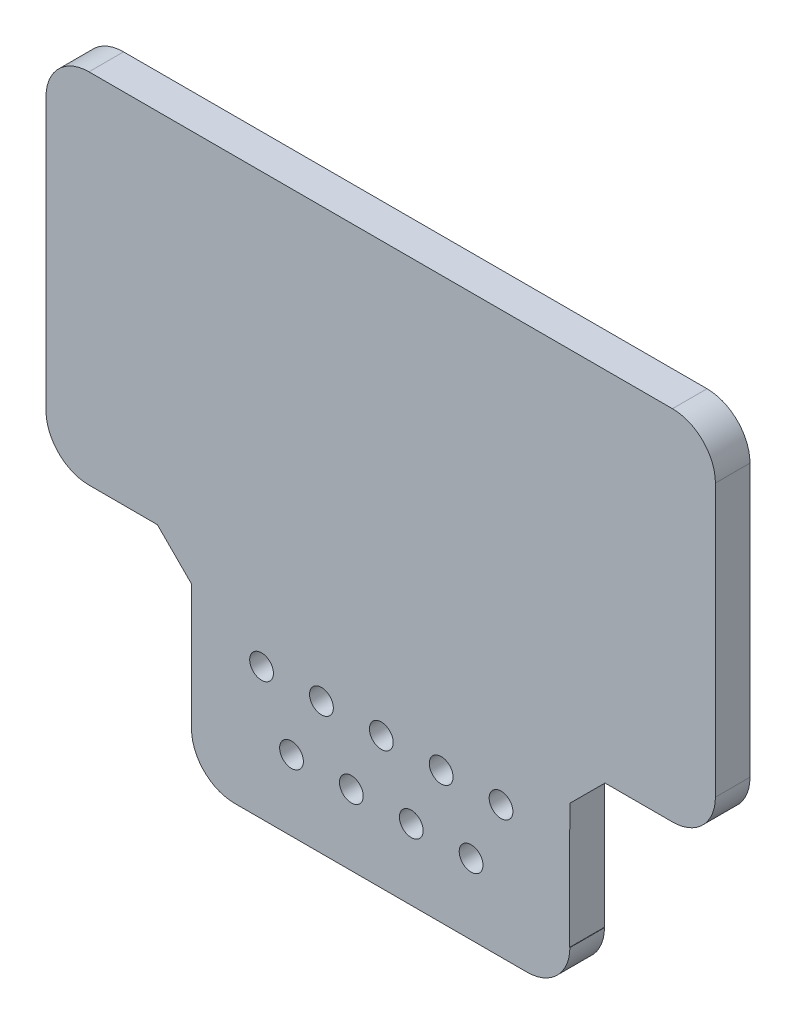
ISO-10303-21;
HEADER;
FILE_DESCRIPTION(('STEP AP214'),'2;1');
FILE_NAME('part.step','',(''),(''),'','','');
FILE_SCHEMA(('AUTOMOTIVE_DESIGN { 1 0 10303 214 1 1 1 1 }'));
ENDSEC;
DATA;
#1=APPLICATION_CONTEXT('core data for automotive mechanical design processes');
#2=APPLICATION_PROTOCOL_DEFINITION('international standard','automotive_design',2000,#1);
#3=PRODUCT_CONTEXT('',#1,'mechanical');
#4=PRODUCT('Part','Part','',(#3));
#5=PRODUCT_RELATED_PRODUCT_CATEGORY('part','',(#4));
#6=PRODUCT_DEFINITION_FORMATION('','',#4);
#7=PRODUCT_DEFINITION_CONTEXT('part definition',#1,'design');
#8=PRODUCT_DEFINITION('design','',#6,#7);
#9=PRODUCT_DEFINITION_SHAPE('','',#8);
#10=(LENGTH_UNIT() NAMED_UNIT(*) SI_UNIT(.MILLI.,.METRE.));
#11=(NAMED_UNIT(*) PLANE_ANGLE_UNIT() SI_UNIT($,.RADIAN.));
#12=(NAMED_UNIT(*) SI_UNIT($,.STERADIAN.) SOLID_ANGLE_UNIT());
#13=UNCERTAINTY_MEASURE_WITH_UNIT(LENGTH_MEASURE(1.E-05),#10,'distance_accuracy_value','');
#14=(GEOMETRIC_REPRESENTATION_CONTEXT(3) GLOBAL_UNCERTAINTY_ASSIGNED_CONTEXT((#13)) GLOBAL_UNIT_ASSIGNED_CONTEXT((#10,
#11,#12)) REPRESENTATION_CONTEXT('',''));
#15=CARTESIAN_POINT('',(0.,0.,0.));
#16=DIRECTION('',(0.,0.,1.));
#17=DIRECTION('',(1.,0.,0.));
#18=AXIS2_PLACEMENT_3D('',#15,#16,#17);
#19=CARTESIAN_POINT('',(103.63220726441,-45.05379222758,0.));
#20=DIRECTION('',(0.,0.,-1.));
#21=DIRECTION('',(-1.,0.,0.));
#22=AXIS2_PLACEMENT_3D('',#19,#20,#21);
#23=CYLINDRICAL_SURFACE('',#22,0.01270002540005);
#24=CARTESIAN_POINT('',(103.63220726441,-45.05379222758,1.600050800102));
#25=DIRECTION('',(0.,0.,-1.));
#26=DIRECTION('',(-1.,0.,0.));
#27=AXIS2_PLACEMENT_3D('',#24,#25,#26);
#28=CIRCLE('',#27,0.01270002540005);
#29=CARTESIAN_POINT('',(103.619507241386,-45.0537885438644,1.600050800102));
#30=VERTEX_POINT('',#29);
#31=CARTESIAN_POINT('',(103.629648645832,-45.06623184639,1.600050800102));
#32=VERTEX_POINT('',#31);
#33=EDGE_CURVE('E180',#30,#32,#28,.F.);
#34=ORIENTED_EDGE('',*,*,#33,.T.);
#35=DIRECTION('',(0.,0.,-1.));
#36=VECTOR('',#35,1.);
#37=CARTESIAN_POINT('',(103.629648645832,-45.06623184639,0.));
#38=LINE('',#37,#36);
#39=CARTESIAN_POINT('',(103.629648645832,-45.06623184639,0.));
#40=VERTEX_POINT('',#39);
#41=EDGE_CURVE('E301',#40,#32,#38,.F.);
#42=ORIENTED_EDGE('',*,*,#41,.F.);
#43=CARTESIAN_POINT('',(103.63220726441,-45.05379222758,0.));
#44=DIRECTION('',(0.,0.,-1.));
#45=DIRECTION('',(-1.,0.,0.));
#46=AXIS2_PLACEMENT_3D('',#43,#44,#45);
#47=CIRCLE('',#46,0.01270002540005);
#48=CARTESIAN_POINT('',(103.619507241385,-45.0537885438644,0.));
#49=VERTEX_POINT('',#48);
#50=EDGE_CURVE('E20',#49,#40,#47,.F.);
#51=ORIENTED_EDGE('',*,*,#50,.F.);
#52=DIRECTION('',(0.,0.,1.));
#53=VECTOR('',#52,1.);
#54=CARTESIAN_POINT('',(103.619507239012,-45.05379222758,0.));
#55=LINE('',#54,#53);
#56=EDGE_CURVE('E207',#30,#49,#55,.F.);
#57=ORIENTED_EDGE('',*,*,#56,.F.);
#58=EDGE_LOOP('',(#34,#42,#51,#57));
#59=FACE_BOUND('',#58,.T.);
#60=ADVANCED_FACE('F17',(#59),#23,.F.);
#61=CARTESIAN_POINT('',(94.8739811879,-32.76412805376,1.600050800102));
#62=DIRECTION('',(0.,0.,-1.));
#63=DIRECTION('',(-1.,0.,0.));
#64=AXIS2_PLACEMENT_3D('',#61,#62,#63);
#65=PLANE('',#64);
#66=CARTESIAN_POINT('',(89.362522225044,-40.93426466852,1.600050800102));
#67=DIRECTION('',(0.,0.,1.));
#68=DIRECTION('',(1.,0.,0.));
#69=AXIS2_PLACEMENT_3D('',#66,#67,#68);
#70=CIRCLE('',#69,0.550012700025);
#71=CARTESIAN_POINT('',(89.912534925069,-40.93426466852,1.600050800102));
#72=VERTEX_POINT('',#71);
#73=EDGE_CURVE('E264',#72,#72,#70,.F.);
#74=ORIENTED_EDGE('',*,*,#73,.T.);
#75=EDGE_LOOP('',(#74));
#76=FACE_BOUND('',#75,.T.);
#77=CARTESIAN_POINT('',(92.132651765304,-40.93426466852,1.600050800102));
#78=DIRECTION('',(0.,0.,1.));
#79=DIRECTION('',(1.,0.,0.));
#80=AXIS2_PLACEMENT_3D('',#77,#78,#79);
#81=CIRCLE('',#80,0.550012700025);
#82=CARTESIAN_POINT('',(92.682664465329,-40.93426466852,1.600050800102));
#83=VERTEX_POINT('',#82);
#84=EDGE_CURVE('E267',#83,#83,#81,.F.);
#85=ORIENTED_EDGE('',*,*,#84,.T.);
#86=EDGE_LOOP('',(#85));
#87=FACE_BOUND('',#86,.T.);
#88=CARTESIAN_POINT('',(94.902527305055,-40.93426466852,1.600050800102));
#89=DIRECTION('',(0.,0.,1.));
#90=DIRECTION('',(1.,0.,0.));
#91=AXIS2_PLACEMENT_3D('',#88,#89,#90);
#92=CIRCLE('',#91,0.550012700025);
#93=CARTESIAN_POINT('',(95.45254000508,-40.93426466852,1.600050800102));
#94=VERTEX_POINT('',#93);
#95=EDGE_CURVE('E270',#94,#94,#92,.F.);
#96=ORIENTED_EDGE('',*,*,#95,.T.);
#97=EDGE_LOOP('',(#96));
#98=FACE_BOUND('',#97,.T.);
#99=CARTESIAN_POINT('',(97.672656845314,-40.93426466852,1.600050800102));
#100=DIRECTION('',(0.,0.,1.));
#101=DIRECTION('',(1.,0.,0.));
#102=AXIS2_PLACEMENT_3D('',#99,#100,#101);
#103=CIRCLE('',#102,0.550012700025);
#104=CARTESIAN_POINT('',(98.222669545339,-40.93426466852,1.600050800102));
#105=VERTEX_POINT('',#104);
#106=EDGE_CURVE('E273',#105,#105,#103,.F.);
#107=ORIENTED_EDGE('',*,*,#106,.T.);
#108=EDGE_LOOP('',(#107));
#109=FACE_BOUND('',#108,.T.);
#110=CARTESIAN_POINT('',(100.44253238506,-40.93451866903,1.600050800102));
#111=DIRECTION('',(0.,0.,1.));
#112=DIRECTION('',(1.,0.,0.));
#113=AXIS2_PLACEMENT_3D('',#110,#111,#112);
#114=CIRCLE('',#113,0.550012700025);
#115=CARTESIAN_POINT('',(100.992545085085,-40.93451866903,1.600050800102));
#116=VERTEX_POINT('',#115);
#117=EDGE_CURVE('E276',#116,#116,#114,.F.);
#118=ORIENTED_EDGE('',*,*,#117,.T.);
#119=EDGE_LOOP('',(#118));
#120=FACE_BOUND('',#119,.T.);
#121=CARTESIAN_POINT('',(90.747586995174,-43.77424434848,1.600050800102));
#122=DIRECTION('',(0.,0.,1.));
#123=DIRECTION('',(1.,0.,0.));
#124=AXIS2_PLACEMENT_3D('',#121,#122,#123);
#125=CIRCLE('',#124,0.550012700025);
#126=CARTESIAN_POINT('',(91.297599695199,-43.77424434848,1.600050800102));
#127=VERTEX_POINT('',#126);
#128=EDGE_CURVE('E279',#127,#127,#125,.F.);
#129=ORIENTED_EDGE('',*,*,#128,.T.);
#130=EDGE_LOOP('',(#129));
#131=FACE_BOUND('',#130,.T.);
#132=CARTESIAN_POINT('',(93.517462534925,-43.77424434848,1.600050800102));
#133=DIRECTION('',(0.,0.,1.));
#134=DIRECTION('',(1.,0.,0.));
#135=AXIS2_PLACEMENT_3D('',#132,#133,#134);
#136=CIRCLE('',#135,0.550012700025);
#137=CARTESIAN_POINT('',(94.06747523495,-43.77424434848,1.600050800102));
#138=VERTEX_POINT('',#137);
#139=EDGE_CURVE('E282',#138,#138,#136,.F.);
#140=ORIENTED_EDGE('',*,*,#139,.T.);
#141=EDGE_LOOP('',(#140));
#142=FACE_BOUND('',#141,.T.);
#143=CARTESIAN_POINT('',(96.287592075184,-43.77424434848,1.600050800102));
#144=DIRECTION('',(0.,0.,1.));
#145=DIRECTION('',(1.,0.,0.));
#146=AXIS2_PLACEMENT_3D('',#143,#144,#145);
#147=CIRCLE('',#146,0.550012700025);
#148=CARTESIAN_POINT('',(96.837604775209,-43.77424434848,1.600050800102));
#149=VERTEX_POINT('',#148);
#150=EDGE_CURVE('E285',#149,#149,#147,.F.);
#151=ORIENTED_EDGE('',*,*,#150,.T.);
#152=EDGE_LOOP('',(#151));
#153=FACE_BOUND('',#152,.T.);
#154=CARTESIAN_POINT('',(99.057467614935,-43.77424434848,1.600050800102));
#155=DIRECTION('',(0.,0.,1.));
#156=DIRECTION('',(1.,0.,0.));
#157=AXIS2_PLACEMENT_3D('',#154,#155,#156);
#158=CIRCLE('',#157,0.550012700025);
#159=CARTESIAN_POINT('',(99.60748031496,-43.77424434848,1.600050800102));
#160=VERTEX_POINT('',#159);
#161=EDGE_CURVE('E288',#160,#160,#158,.F.);
#162=ORIENTED_EDGE('',*,*,#161,.T.);
#163=EDGE_LOOP('',(#162));
#164=FACE_BOUND('',#163,.T.);
#165=DIRECTION('',(0.,1.,0.));
#166=VECTOR('',#165,1.);
#167=CARTESIAN_POINT('',(79.387858775718,-35.66959359918,1.600050800102));
#168=LINE('',#167,#166);
#169=CARTESIAN_POINT('',(79.387858775718,-35.66959359918,1.600050800102));
#170=VERTEX_POINT('',#169);
#171=CARTESIAN_POINT('',(79.387858775718,-23.08204724409,1.600050800102));
#172=VERTEX_POINT('',#171);
#173=EDGE_CURVE('E181',#170,#172,#168,.T.);
#174=ORIENTED_EDGE('',*,*,#173,.F.);
#175=CARTESIAN_POINT('',(81.375163830328,-35.66959359918,1.600050800102));
#176=DIRECTION('',(0.,0.,-1.));
#177=DIRECTION('',(-1.,0.,0.));
#178=AXIS2_PLACEMENT_3D('',#175,#176,#177);
#179=CIRCLE('',#178,1.98730505461);
#180=CARTESIAN_POINT('',(81.375163830328,-37.6568986537908,1.600050800102));
#181=VERTEX_POINT('',#180);
#182=EDGE_CURVE('E295',#181,#170,#179,.T.);
#183=ORIENTED_EDGE('',*,*,#182,.F.);
#184=DIRECTION('',(0.999999310020869,-0.00117471604505485,0.));
#185=VECTOR('',#184,1.);
#186=CARTESIAN_POINT('',(84.541672679466,-37.66061840511,1.600050800102));
#187=LINE('',#186,#185);
#188=CARTESIAN_POINT('',(84.5416726794659,-37.6606184051101,1.600050800102));
#189=VERTEX_POINT('',#188);
#190=EDGE_CURVE('E184',#189,#181,#187,.F.);
#191=ORIENTED_EDGE('',*,*,#190,.F.);
#192=DIRECTION('',(0.705929895423157,-0.708281711431158,0.));
#193=VECTOR('',#192,1.);
#194=CARTESIAN_POINT('',(86.120690881382,-39.24489712979,1.600050800102));
#195=LINE('',#194,#193);
#196=CARTESIAN_POINT('',(86.120690881382,-39.24489712979,1.600050800102));
#197=VERTEX_POINT('',#196);
#198=EDGE_CURVE('E190',#197,#189,#195,.F.);
#199=ORIENTED_EDGE('',*,*,#198,.F.);
#200=DIRECTION('',(0.,-1.,0.));
#201=VECTOR('',#200,1.);
#202=CARTESIAN_POINT('',(86.120690881382,-45.05379222758,1.600050800102));
#203=LINE('',#202,#201);
#204=CARTESIAN_POINT('',(86.120690881382,-45.05379222758,1.600050800102));
#205=VERTEX_POINT('',#204);
#206=EDGE_CURVE('E196',#205,#197,#203,.F.);
#207=ORIENTED_EDGE('',*,*,#206,.F.);
#208=CARTESIAN_POINT('',(88.107995935992,-45.05379222758,1.600050800102));
#209=DIRECTION('',(0.,0.,-1.));
#210=DIRECTION('',(-1.,0.,0.));
#211=AXIS2_PLACEMENT_3D('',#208,#209,#210);
#212=CIRCLE('',#211,1.98730505461);
#213=CARTESIAN_POINT('',(88.107995935992,-47.04109728219,1.600050800102));
#214=VERTEX_POINT('',#213);
#215=EDGE_CURVE('E297',#214,#205,#212,.T.);
#216=ORIENTED_EDGE('',*,*,#215,.F.);
#217=DIRECTION('',(1.,0.,0.));
#218=VECTOR('',#217,1.);
#219=CARTESIAN_POINT('',(101.64238252476,-47.04109728219,1.600050800102));
#220=LINE('',#219,#218);
#221=CARTESIAN_POINT('',(101.64238252476,-47.04109728219,1.600050800102));
#222=VERTEX_POINT('',#221);
#223=EDGE_CURVE('E202',#222,#214,#220,.F.);
#224=ORIENTED_EDGE('',*,*,#223,.F.);
#225=CARTESIAN_POINT('',(101.64238252476,-45.05379222758,1.600050800102));
#226=DIRECTION('',(0.,0.,-1.));
#227=DIRECTION('',(-1.,0.,0.));
#228=AXIS2_PLACEMENT_3D('',#225,#226,#227);
#229=CIRCLE('',#228,1.98730505461);
#230=EDGE_CURVE('E299',#32,#222,#229,.T.);
#231=ORIENTED_EDGE('',*,*,#230,.F.);
#232=ORIENTED_EDGE('',*,*,#33,.F.);
#233=DIRECTION('',(0.000644568505541106,0.999999792265699,0.));
#234=VECTOR('',#233,1.);
#235=CARTESIAN_POINT('',(103.62322699033,-39.28287646963,1.600050800102));
#236=LINE('',#235,#234);
#237=CARTESIAN_POINT('',(103.62322699033,-39.2828764696295,1.600050800102));
#238=VERTEX_POINT('',#237);
#239=EDGE_CURVE('E152',#238,#30,#236,.F.);
#240=ORIENTED_EDGE('',*,*,#239,.F.);
#241=DIRECTION('',(0.708247860724952,0.705963857274952,0.));
#242=VECTOR('',#241,1.);
#243=CARTESIAN_POINT('',(105.25446532893,-37.65689865379,1.600050800102));
#244=LINE('',#243,#242);
#245=CARTESIAN_POINT('',(105.25446532893,-37.65689865379,1.600050800102));
#246=VERTEX_POINT('',#245);
#247=EDGE_CURVE('E135',#246,#238,#244,.F.);
#248=ORIENTED_EDGE('',*,*,#247,.F.);
#249=DIRECTION('',(1.,0.,0.));
#250=VECTOR('',#249,1.);
#251=CARTESIAN_POINT('',(108.37521463042,-37.65689865379,1.600050800102));
#252=LINE('',#251,#250);
#253=CARTESIAN_POINT('',(108.37521463042,-37.65689865379,1.600050800102));
#254=VERTEX_POINT('',#253);
#255=EDGE_CURVE('E141',#254,#246,#252,.F.);
#256=ORIENTED_EDGE('',*,*,#255,.F.);
#257=CARTESIAN_POINT('',(108.37521463042,-35.66959359918,1.600050800102));
#258=DIRECTION('',(0.,0.,-1.));
#259=DIRECTION('',(-1.,0.,0.));
#260=AXIS2_PLACEMENT_3D('',#257,#258,#259);
#261=CIRCLE('',#260,1.98730505461);
#262=CARTESIAN_POINT('',(110.36251968503,-35.66959359918,1.600050800102));
#263=VERTEX_POINT('',#262);
#264=EDGE_CURVE('E166',#263,#254,#261,.T.);
#265=ORIENTED_EDGE('',*,*,#264,.F.);
#266=DIRECTION('',(0.,1.,0.));
#267=VECTOR('',#266,1.);
#268=CARTESIAN_POINT('',(110.36251968503,-23.08204724409,1.600050800102));
#269=LINE('',#268,#267);
#270=CARTESIAN_POINT('',(110.36251968503,-23.08204724409,1.600050800102));
#271=VERTEX_POINT('',#270);
#272=EDGE_CURVE('E170',#271,#263,#269,.F.);
#273=ORIENTED_EDGE('',*,*,#272,.F.);
#274=CARTESIAN_POINT('',(108.37521463042,-23.08204724409,1.600050800102));
#275=DIRECTION('',(0.,0.,-1.));
#276=DIRECTION('',(-1.,0.,0.));
#277=AXIS2_PLACEMENT_3D('',#274,#275,#276);
#278=CIRCLE('',#277,1.98730505461);
#279=CARTESIAN_POINT('',(108.37521463042,-21.09474218948,1.600050800102));
#280=VERTEX_POINT('',#279);
#281=EDGE_CURVE('E174',#280,#271,#278,.T.);
#282=ORIENTED_EDGE('',*,*,#281,.F.);
#283=DIRECTION('',(1.,0.,0.));
#284=VECTOR('',#283,1.);
#285=CARTESIAN_POINT('',(81.375163830328,-21.09474218948,1.600050800102));
#286=LINE('',#285,#284);
#287=CARTESIAN_POINT('',(81.375163830328,-21.09474218948,1.600050800102));
#288=VERTEX_POINT('',#287);
#289=EDGE_CURVE('E178',#288,#280,#286,.T.);
#290=ORIENTED_EDGE('',*,*,#289,.F.);
#291=CARTESIAN_POINT('',(81.375163830328,-23.08204724409,1.600050800102));
#292=DIRECTION('',(0.,0.,-1.));
#293=DIRECTION('',(-1.,0.,0.));
#294=AXIS2_PLACEMENT_3D('',#291,#292,#293);
#295=CIRCLE('',#294,1.98730505461);
#296=EDGE_CURVE('E292',#172,#288,#295,.T.);
#297=ORIENTED_EDGE('',*,*,#296,.F.);
#298=EDGE_LOOP('',(#174,#183,#191,#199,#207,#216,#224,#231,#232,#240,#248,#256,#265,#273,#282,
#290,#297));
#299=FACE_BOUND('',#298,.T.);
#300=ADVANCED_FACE('F150',(#76,#87,#98,#109,#120,#131,#142,#153,#164,#299),#65,.F.);
#301=CARTESIAN_POINT('',(81.375163830328,-21.09474218948,0.));
#302=DIRECTION('',(0.,1.,0.));
#303=DIRECTION('',(0.,0.,1.));
#304=AXIS2_PLACEMENT_3D('',#301,#302,#303);
#305=PLANE('',#304);
#306=DIRECTION('',(0.,0.,-1.));
#307=VECTOR('',#306,1.);
#308=CARTESIAN_POINT('',(108.37521463042,-21.09474218948,0.));
#309=LINE('',#308,#307);
#310=CARTESIAN_POINT('',(108.37521463042,-21.09474218948,0.));
#311=VERTEX_POINT('',#310);
#312=EDGE_CURVE('E175',#311,#280,#309,.F.);
#313=ORIENTED_EDGE('',*,*,#312,.F.);
#314=DIRECTION('',(-1.,0.,0.));
#315=VECTOR('',#314,1.);
#316=CARTESIAN_POINT('',(94.8739811879,-21.09474218948,0.));
#317=LINE('',#316,#315);
#318=CARTESIAN_POINT('',(81.375163830328,-21.09474218948,0.));
#319=VERTEX_POINT('',#318);
#320=EDGE_CURVE('E263',#319,#311,#317,.F.);
#321=ORIENTED_EDGE('',*,*,#320,.F.);
#322=DIRECTION('',(0.,0.,-1.));
#323=VECTOR('',#322,1.);
#324=CARTESIAN_POINT('',(81.375163830328,-21.09474218948,0.));
#325=LINE('',#324,#323);
#326=EDGE_CURVE('E291',#288,#319,#325,.T.);
#327=ORIENTED_EDGE('',*,*,#326,.F.);
#328=ORIENTED_EDGE('',*,*,#289,.T.);
#329=EDGE_LOOP('',(#313,#321,#327,#328));
#330=FACE_BOUND('',#329,.T.);
#331=ADVANCED_FACE('F375',(#330),#305,.T.);
#332=CARTESIAN_POINT('',(108.37521463042,-23.08204724409,0.));
#333=DIRECTION('',(0.,0.,-1.));
#334=DIRECTION('',(-1.,0.,0.));
#335=AXIS2_PLACEMENT_3D('',#332,#333,#334);
#336=CYLINDRICAL_SURFACE('',#335,1.98730505461);
#337=DIRECTION('',(0.,0.,-1.));
#338=VECTOR('',#337,1.);
#339=CARTESIAN_POINT('',(110.36251968503,-23.08204724409,0.));
#340=LINE('',#339,#338);
#341=CARTESIAN_POINT('',(110.36251968503,-23.08204724409,0.));
#342=VERTEX_POINT('',#341);
#343=EDGE_CURVE('E171',#342,#271,#340,.F.);
#344=ORIENTED_EDGE('',*,*,#343,.F.);
#345=CARTESIAN_POINT('',(108.37521463042,-23.08204724409,0.));
#346=DIRECTION('',(0.,0.,-1.));
#347=DIRECTION('',(-1.,0.,0.));
#348=AXIS2_PLACEMENT_3D('',#345,#346,#347);
#349=CIRCLE('',#348,1.98730505461);
#350=EDGE_CURVE('E260',#311,#342,#349,.T.);
#351=ORIENTED_EDGE('',*,*,#350,.F.);
#352=ORIENTED_EDGE('',*,*,#312,.T.);
#353=ORIENTED_EDGE('',*,*,#281,.T.);
#354=EDGE_LOOP('',(#344,#351,#352,#353));
#355=FACE_BOUND('',#354,.T.);
#356=ADVANCED_FACE('F373',(#355),#336,.T.);
#357=CARTESIAN_POINT('',(110.36251968503,-23.08204724409,0.));
#358=DIRECTION('',(1.,0.,0.));
#359=DIRECTION('',(0.,0.,-1.));
#360=AXIS2_PLACEMENT_3D('',#357,#358,#359);
#361=PLANE('',#360);
#362=DIRECTION('',(0.,0.,-1.));
#363=VECTOR('',#362,1.);
#364=CARTESIAN_POINT('',(110.36251968503,-35.66959359918,0.));
#365=LINE('',#364,#363);
#366=CARTESIAN_POINT('',(110.36251968503,-35.66959359918,0.));
#367=VERTEX_POINT('',#366);
#368=EDGE_CURVE('E167',#367,#263,#365,.F.);
#369=ORIENTED_EDGE('',*,*,#368,.F.);
#370=DIRECTION('',(0.,1.,0.));
#371=VECTOR('',#370,1.);
#372=CARTESIAN_POINT('',(110.36251968503,-32.76412805376,0.));
#373=LINE('',#372,#371);
#374=EDGE_CURVE('E259',#342,#367,#373,.F.);
#375=ORIENTED_EDGE('',*,*,#374,.F.);
#376=ORIENTED_EDGE('',*,*,#343,.T.);
#377=ORIENTED_EDGE('',*,*,#272,.T.);
#378=EDGE_LOOP('',(#369,#375,#376,#377));
#379=FACE_BOUND('',#378,.T.);
#380=ADVANCED_FACE('F370',(#379),#361,.T.);
#381=CARTESIAN_POINT('',(108.37521463042,-35.66959359918,0.));
#382=DIRECTION('',(0.,0.,-1.));
#383=DIRECTION('',(-1.,0.,0.));
#384=AXIS2_PLACEMENT_3D('',#381,#382,#383);
#385=CYLINDRICAL_SURFACE('',#384,1.98730505461);
#386=DIRECTION('',(0.,0.,1.));
#387=VECTOR('',#386,1.);
#388=CARTESIAN_POINT('',(108.37521463042,-37.65689865379,0.));
#389=LINE('',#388,#387);
#390=CARTESIAN_POINT('',(108.37521463042,-37.65689865379,0.));
#391=VERTEX_POINT('',#390);
#392=EDGE_CURVE('E145',#391,#254,#389,.T.);
#393=ORIENTED_EDGE('',*,*,#392,.F.);
#394=CARTESIAN_POINT('',(108.37521463042,-35.66959359918,0.));
#395=DIRECTION('',(0.,0.,-1.));
#396=DIRECTION('',(-1.,0.,0.));
#397=AXIS2_PLACEMENT_3D('',#394,#395,#396);
#398=CIRCLE('',#397,1.98730505461);
#399=EDGE_CURVE('E255',#367,#391,#398,.T.);
#400=ORIENTED_EDGE('',*,*,#399,.F.);
#401=ORIENTED_EDGE('',*,*,#368,.T.);
#402=ORIENTED_EDGE('',*,*,#264,.T.);
#403=EDGE_LOOP('',(#393,#400,#401,#402));
#404=FACE_BOUND('',#403,.T.);
#405=ADVANCED_FACE('F366',(#404),#385,.T.);
#406=CARTESIAN_POINT('',(108.37521463042,-37.65689865379,0.));
#407=DIRECTION('',(0.,-1.,0.));
#408=DIRECTION('',(1.,0.,0.));
#409=AXIS2_PLACEMENT_3D('',#406,#407,#408);
#410=PLANE('',#409);
#411=DIRECTION('',(0.,0.,1.));
#412=VECTOR('',#411,1.);
#413=CARTESIAN_POINT('',(105.25446532893,-37.65689865379,0.));
#414=LINE('',#413,#412);
#415=CARTESIAN_POINT('',(105.25446532893,-37.65689865379,0.));
#416=VERTEX_POINT('',#415);
#417=EDGE_CURVE('E144',#416,#246,#414,.T.);
#418=ORIENTED_EDGE('',*,*,#417,.F.);
#419=DIRECTION('',(-1.,0.,0.));
#420=VECTOR('',#419,1.);
#421=CARTESIAN_POINT('',(94.8739811879,-37.65689865379,0.));
#422=LINE('',#421,#420);
#423=EDGE_CURVE('E258',#391,#416,#422,.T.);
#424=ORIENTED_EDGE('',*,*,#423,.F.);
#425=ORIENTED_EDGE('',*,*,#392,.T.);
#426=ORIENTED_EDGE('',*,*,#255,.T.);
#427=EDGE_LOOP('',(#418,#424,#425,#426));
#428=FACE_BOUND('',#427,.T.);
#429=ADVANCED_FACE('F142',(#428),#410,.T.);
#430=CARTESIAN_POINT('',(105.25446532893,-37.65689865379,0.));
#431=DIRECTION('',(0.705963857274952,-0.708247860724952,0.));
#432=DIRECTION('',(0.708247860724952,0.705963857274952,0.));
#433=AXIS2_PLACEMENT_3D('',#430,#431,#432);
#434=PLANE('',#433);
#435=DIRECTION('',(0.,0.,1.));
#436=VECTOR('',#435,1.);
#437=CARTESIAN_POINT('',(103.62322699033,-39.28287646963,0.));
#438=LINE('',#437,#436);
#439=CARTESIAN_POINT('',(103.62322699033,-39.28287646963,0.));
#440=VERTEX_POINT('',#439);
#441=EDGE_CURVE('E127',#440,#238,#438,.T.);
#442=ORIENTED_EDGE('',*,*,#441,.F.);
#443=DIRECTION('',(-0.70824786072432,-0.705963857275587,0.));
#444=VECTOR('',#443,1.);
#445=CARTESIAN_POINT('',(105.25446532893,-37.65689865379,0.));
#446=LINE('',#445,#444);
#447=EDGE_CURVE('E156',#416,#440,#446,.T.);
#448=ORIENTED_EDGE('',*,*,#447,.F.);
#449=ORIENTED_EDGE('',*,*,#417,.T.);
#450=ORIENTED_EDGE('',*,*,#247,.T.);
#451=EDGE_LOOP('',(#442,#448,#449,#450));
#452=FACE_BOUND('',#451,.T.);
#453=ADVANCED_FACE('F154',(#452),#434,.T.);
#454=CARTESIAN_POINT('',(103.62322699033,-39.28287646963,0.));
#455=DIRECTION('',(0.999999792265699,-0.000644568505541106,0.));
#456=DIRECTION('',(0.000644568505541106,0.999999792265699,0.));
#457=AXIS2_PLACEMENT_3D('',#454,#455,#456);
#458=PLANE('',#457);
#459=ORIENTED_EDGE('',*,*,#56,.T.);
#460=DIRECTION('',(-0.0006445685058125,-0.999999792265699,0.));
#461=VECTOR('',#460,1.);
#462=CARTESIAN_POINT('',(103.62322699033,-39.28287646963,0.));
#463=LINE('',#462,#461);
#464=EDGE_CURVE('E254',#440,#49,#463,.T.);
#465=ORIENTED_EDGE('',*,*,#464,.F.);
#466=ORIENTED_EDGE('',*,*,#441,.T.);
#467=ORIENTED_EDGE('',*,*,#239,.T.);
#468=EDGE_LOOP('',(#459,#465,#466,#467));
#469=FACE_BOUND('',#468,.T.);
#470=ADVANCED_FACE('F482',(#469),#458,.T.);
#471=CARTESIAN_POINT('',(101.64238252476,-45.05379222758,0.));
#472=DIRECTION('',(0.,0.,-1.));
#473=DIRECTION('',(-1.,0.,0.));
#474=AXIS2_PLACEMENT_3D('',#471,#472,#473);
#475=CYLINDRICAL_SURFACE('',#474,1.98730505461);
#476=DIRECTION('',(0.,0.,1.));
#477=VECTOR('',#476,1.);
#478=CARTESIAN_POINT('',(101.64238252476,-47.04109728219,0.));
#479=LINE('',#478,#477);
#480=CARTESIAN_POINT('',(101.64238252476,-47.04109728219,0.));
#481=VERTEX_POINT('',#480);
#482=EDGE_CURVE('E205',#481,#222,#479,.T.);
#483=ORIENTED_EDGE('',*,*,#482,.F.);
#484=CARTESIAN_POINT('',(101.64238252476,-45.05379222758,0.));
#485=DIRECTION('',(0.,0.,-1.));
#486=DIRECTION('',(-1.,0.,0.));
#487=AXIS2_PLACEMENT_3D('',#484,#485,#486);
#488=CIRCLE('',#487,1.98730505461);
#489=EDGE_CURVE('E251',#40,#481,#488,.T.);
#490=ORIENTED_EDGE('',*,*,#489,.F.);
#491=ORIENTED_EDGE('',*,*,#41,.T.);
#492=ORIENTED_EDGE('',*,*,#230,.T.);
#493=EDGE_LOOP('',(#483,#490,#491,#492));
#494=FACE_BOUND('',#493,.T.);
#495=ADVANCED_FACE('F313',(#494),#475,.T.);
#496=CARTESIAN_POINT('',(101.64238252476,-47.04109728219,0.));
#497=DIRECTION('',(0.,-1.,0.));
#498=DIRECTION('',(1.,0.,0.));
#499=AXIS2_PLACEMENT_3D('',#496,#497,#498);
#500=PLANE('',#499);
#501=DIRECTION('',(0.,0.,-1.));
#502=VECTOR('',#501,1.);
#503=CARTESIAN_POINT('',(88.107995935992,-47.04109728219,0.));
#504=LINE('',#503,#502);
#505=CARTESIAN_POINT('',(88.107995935992,-47.04109728219,0.));
#506=VERTEX_POINT('',#505);
#507=EDGE_CURVE('E204',#506,#214,#504,.F.);
#508=ORIENTED_EDGE('',*,*,#507,.F.);
#509=DIRECTION('',(-1.,0.,0.));
#510=VECTOR('',#509,1.);
#511=CARTESIAN_POINT('',(94.8739811879,-47.04109728219,0.));
#512=LINE('',#511,#510);
#513=EDGE_CURVE('E250',#481,#506,#512,.T.);
#514=ORIENTED_EDGE('',*,*,#513,.F.);
#515=ORIENTED_EDGE('',*,*,#482,.T.);
#516=ORIENTED_EDGE('',*,*,#223,.T.);
#517=EDGE_LOOP('',(#508,#514,#515,#516));
#518=FACE_BOUND('',#517,.T.);
#519=ADVANCED_FACE('F319',(#518),#500,.T.);
#520=CARTESIAN_POINT('',(88.107995935992,-45.05379222758,0.));
#521=DIRECTION('',(0.,0.,-1.));
#522=DIRECTION('',(-1.,0.,0.));
#523=AXIS2_PLACEMENT_3D('',#520,#521,#522);
#524=CYLINDRICAL_SURFACE('',#523,1.98730505461);
#525=DIRECTION('',(0.,0.,1.));
#526=VECTOR('',#525,1.);
#527=CARTESIAN_POINT('',(86.120690881382,-45.05379222758,0.));
#528=LINE('',#527,#526);
#529=CARTESIAN_POINT('',(86.120690881382,-45.05379222758,0.));
#530=VERTEX_POINT('',#529);
#531=EDGE_CURVE('E199',#530,#205,#528,.T.);
#532=ORIENTED_EDGE('',*,*,#531,.F.);
#533=CARTESIAN_POINT('',(88.107995935992,-45.05379222758,0.));
#534=DIRECTION('',(0.,0.,-1.));
#535=DIRECTION('',(-1.,0.,0.));
#536=AXIS2_PLACEMENT_3D('',#533,#534,#535);
#537=CIRCLE('',#536,1.98730505461);
#538=EDGE_CURVE('E246',#506,#530,#537,.T.);
#539=ORIENTED_EDGE('',*,*,#538,.F.);
#540=ORIENTED_EDGE('',*,*,#507,.T.);
#541=ORIENTED_EDGE('',*,*,#215,.T.);
#542=EDGE_LOOP('',(#532,#539,#540,#541));
#543=FACE_BOUND('',#542,.T.);
#544=ADVANCED_FACE('F490',(#543),#524,.T.);
#545=CARTESIAN_POINT('',(86.120690881382,-45.05379222758,0.));
#546=DIRECTION('',(-1.,0.,0.));
#547=DIRECTION('',(0.,-1.,0.));
#548=AXIS2_PLACEMENT_3D('',#545,#546,#547);
#549=PLANE('',#548);
#550=DIRECTION('',(0.,0.,1.));
#551=VECTOR('',#550,1.);
#552=CARTESIAN_POINT('',(86.120690881382,-39.24489712979,0.));
#553=LINE('',#552,#551);
#554=CARTESIAN_POINT('',(86.120690881382,-39.24489712979,0.));
#555=VERTEX_POINT('',#554);
#556=EDGE_CURVE('E193',#555,#197,#553,.T.);
#557=ORIENTED_EDGE('',*,*,#556,.F.);
#558=DIRECTION('',(0.,1.,0.));
#559=VECTOR('',#558,1.);
#560=CARTESIAN_POINT('',(86.120690881382,-32.76412805376,0.));
#561=LINE('',#560,#559);
#562=EDGE_CURVE('E249',#530,#555,#561,.T.);
#563=ORIENTED_EDGE('',*,*,#562,.F.);
#564=ORIENTED_EDGE('',*,*,#531,.T.);
#565=ORIENTED_EDGE('',*,*,#206,.T.);
#566=EDGE_LOOP('',(#557,#563,#564,#565));
#567=FACE_BOUND('',#566,.T.);
#568=ADVANCED_FACE('F392',(#567),#549,.T.);
#569=CARTESIAN_POINT('',(86.120690881382,-39.24489712979,0.));
#570=DIRECTION('',(-0.708281711431158,-0.705929895423157,0.));
#571=DIRECTION('',(0.705929895423157,-0.708281711431158,0.));
#572=AXIS2_PLACEMENT_3D('',#569,#570,#571);
#573=PLANE('',#572);
#574=DIRECTION('',(0.,0.,1.));
#575=VECTOR('',#574,1.);
#576=CARTESIAN_POINT('',(84.541672679466,-37.66061840511,0.));
#577=LINE('',#576,#575);
#578=CARTESIAN_POINT('',(84.541672679466,-37.66061840511,0.));
#579=VERTEX_POINT('',#578);
#580=EDGE_CURVE('E187',#579,#189,#577,.T.);
#581=ORIENTED_EDGE('',*,*,#580,.F.);
#582=DIRECTION('',(-0.705929895423008,0.708281711431306,0.));
#583=VECTOR('',#582,1.);
#584=CARTESIAN_POINT('',(86.120690881382,-39.24489712979,0.));
#585=LINE('',#584,#583);
#586=EDGE_CURVE('E348',#555,#579,#585,.T.);
#587=ORIENTED_EDGE('',*,*,#586,.F.);
#588=ORIENTED_EDGE('',*,*,#556,.T.);
#589=ORIENTED_EDGE('',*,*,#198,.T.);
#590=EDGE_LOOP('',(#581,#587,#588,#589));
#591=FACE_BOUND('',#590,.T.);
#592=ADVANCED_FACE('F397',(#591),#573,.T.);
#593=CARTESIAN_POINT('',(84.541672679466,-37.66061840511,0.));
#594=DIRECTION('',(-0.00117471604505485,-0.999999310020869,0.));
#595=DIRECTION('',(0.999999310020869,-0.00117471604505485,0.));
#596=AXIS2_PLACEMENT_3D('',#593,#594,#595);
#597=PLANE('',#596);
#598=DIRECTION('',(0.,0.,-1.));
#599=VECTOR('',#598,1.);
#600=CARTESIAN_POINT('',(81.375163830328,-37.65689865379,0.));
#601=LINE('',#600,#599);
#602=CARTESIAN_POINT('',(81.375163830328,-37.65689865379,0.));
#603=VERTEX_POINT('',#602);
#604=EDGE_CURVE('E186',#603,#181,#601,.F.);
#605=ORIENTED_EDGE('',*,*,#604,.F.);
#606=DIRECTION('',(-0.999999310020868,0.00117471604554661,0.));
#607=VECTOR('',#606,1.);
#608=CARTESIAN_POINT('',(84.541672679466,-37.66061840511,0.));
#609=LINE('',#608,#607);
#610=EDGE_CURVE('E245',#579,#603,#609,.T.);
#611=ORIENTED_EDGE('',*,*,#610,.F.);
#612=ORIENTED_EDGE('',*,*,#580,.T.);
#613=ORIENTED_EDGE('',*,*,#190,.T.);
#614=EDGE_LOOP('',(#605,#611,#612,#613));
#615=FACE_BOUND('',#614,.T.);
#616=ADVANCED_FACE('F402',(#615),#597,.T.);
#617=CARTESIAN_POINT('',(81.375163830328,-35.66959359918,0.));
#618=DIRECTION('',(0.,0.,-1.));
#619=DIRECTION('',(-1.,0.,0.));
#620=AXIS2_PLACEMENT_3D('',#617,#618,#619);
#621=CYLINDRICAL_SURFACE('',#620,1.98730505461);
#622=DIRECTION('',(0.,0.,1.));
#623=VECTOR('',#622,1.);
#624=CARTESIAN_POINT('',(79.387858775718,-35.66959359918,0.));
#625=LINE('',#624,#623);
#626=CARTESIAN_POINT('',(79.387858775718,-35.66959359918,0.));
#627=VERTEX_POINT('',#626);
#628=EDGE_CURVE('E183',#627,#170,#625,.T.);
#629=ORIENTED_EDGE('',*,*,#628,.F.);
#630=CARTESIAN_POINT('',(81.375163830328,-35.66959359918,0.));
#631=DIRECTION('',(0.,0.,-1.));
#632=DIRECTION('',(-1.,0.,0.));
#633=AXIS2_PLACEMENT_3D('',#630,#631,#632);
#634=CIRCLE('',#633,1.98730505461);
#635=EDGE_CURVE('E242',#603,#627,#634,.T.);
#636=ORIENTED_EDGE('',*,*,#635,.F.);
#637=ORIENTED_EDGE('',*,*,#604,.T.);
#638=ORIENTED_EDGE('',*,*,#182,.T.);
#639=EDGE_LOOP('',(#629,#636,#637,#638));
#640=FACE_BOUND('',#639,.T.);
#641=ADVANCED_FACE('F404',(#640),#621,.T.);
#642=CARTESIAN_POINT('',(79.387858775718,-35.66959359918,0.));
#643=DIRECTION('',(-1.,0.,0.));
#644=DIRECTION('',(0.,0.,1.));
#645=AXIS2_PLACEMENT_3D('',#642,#643,#644);
#646=PLANE('',#645);
#647=DIRECTION('',(0.,0.,-1.));
#648=VECTOR('',#647,1.);
#649=CARTESIAN_POINT('',(79.387858775718,-23.08204724409,0.));
#650=LINE('',#649,#648);
#651=CARTESIAN_POINT('',(79.387858775718,-23.08204724409,0.));
#652=VERTEX_POINT('',#651);
#653=EDGE_CURVE('E35',#652,#172,#650,.F.);
#654=ORIENTED_EDGE('',*,*,#653,.F.);
#655=DIRECTION('',(0.,1.,0.));
#656=VECTOR('',#655,1.);
#657=CARTESIAN_POINT('',(79.387858775718,-32.76412805376,0.));
#658=LINE('',#657,#656);
#659=EDGE_CURVE('E241',#627,#652,#658,.T.);
#660=ORIENTED_EDGE('',*,*,#659,.F.);
#661=ORIENTED_EDGE('',*,*,#628,.T.);
#662=ORIENTED_EDGE('',*,*,#173,.T.);
#663=EDGE_LOOP('',(#654,#660,#661,#662));
#664=FACE_BOUND('',#663,.T.);
#665=ADVANCED_FACE('F405',(#664),#646,.T.);
#666=CARTESIAN_POINT('',(81.375163830328,-23.08204724409,0.));
#667=DIRECTION('',(0.,0.,-1.));
#668=DIRECTION('',(-1.,0.,0.));
#669=AXIS2_PLACEMENT_3D('',#666,#667,#668);
#670=CYLINDRICAL_SURFACE('',#669,1.98730505461);
#671=ORIENTED_EDGE('',*,*,#326,.T.);
#672=CARTESIAN_POINT('',(81.375163830328,-23.08204724409,0.));
#673=DIRECTION('',(0.,0.,-1.));
#674=DIRECTION('',(-1.,0.,0.));
#675=AXIS2_PLACEMENT_3D('',#672,#673,#674);
#676=CIRCLE('',#675,1.98730505461);
#677=EDGE_CURVE('E238',#652,#319,#676,.T.);
#678=ORIENTED_EDGE('',*,*,#677,.F.);
#679=ORIENTED_EDGE('',*,*,#653,.T.);
#680=ORIENTED_EDGE('',*,*,#296,.T.);
#681=EDGE_LOOP('',(#671,#678,#679,#680));
#682=FACE_BOUND('',#681,.T.);
#683=ADVANCED_FACE('F380',(#682),#670,.T.);
#684=CARTESIAN_POINT('',(99.057467614935,-43.77424434848,0.));
#685=DIRECTION('',(0.,0.,1.));
#686=DIRECTION('',(1.,0.,0.));
#687=AXIS2_PLACEMENT_3D('',#684,#685,#686);
#688=CYLINDRICAL_SURFACE('',#687,0.550012700025);
#689=CARTESIAN_POINT('',(99.057467614935,-43.77424434848,0.));
#690=DIRECTION('',(0.,0.,1.));
#691=DIRECTION('',(1.,0.,0.));
#692=AXIS2_PLACEMENT_3D('',#689,#690,#691);
#693=CIRCLE('',#692,0.550012700025);
#694=CARTESIAN_POINT('',(99.60748031496,-43.77424434848,0.));
#695=VERTEX_POINT('',#694);
#696=EDGE_CURVE('E235',#695,#695,#693,.T.);
#697=ORIENTED_EDGE('',*,*,#696,.F.);
#698=EDGE_LOOP('',(#697));
#699=FACE_BOUND('',#698,.T.);
#700=ORIENTED_EDGE('',*,*,#161,.F.);
#701=EDGE_LOOP('',(#700));
#702=FACE_BOUND('',#701,.T.);
#703=ADVANCED_FACE('F413',(#699,#702),#688,.F.);
#704=CARTESIAN_POINT('',(96.287592075184,-43.77424434848,0.));
#705=DIRECTION('',(0.,0.,1.));
#706=DIRECTION('',(1.,0.,0.));
#707=AXIS2_PLACEMENT_3D('',#704,#705,#706);
#708=CYLINDRICAL_SURFACE('',#707,0.550012700025);
#709=CARTESIAN_POINT('',(96.287592075184,-43.77424434848,0.));
#710=DIRECTION('',(0.,0.,1.));
#711=DIRECTION('',(1.,0.,0.));
#712=AXIS2_PLACEMENT_3D('',#709,#710,#711);
#713=CIRCLE('',#712,0.550012700025);
#714=CARTESIAN_POINT('',(96.837604775209,-43.77424434848,0.));
#715=VERTEX_POINT('',#714);
#716=EDGE_CURVE('E232',#715,#715,#713,.T.);
#717=ORIENTED_EDGE('',*,*,#716,.F.);
#718=EDGE_LOOP('',(#717));
#719=FACE_BOUND('',#718,.T.);
#720=ORIENTED_EDGE('',*,*,#150,.F.);
#721=EDGE_LOOP('',(#720));
#722=FACE_BOUND('',#721,.T.);
#723=ADVANCED_FACE('F450',(#719,#722),#708,.F.);
#724=CARTESIAN_POINT('',(93.517462534925,-43.77424434848,0.));
#725=DIRECTION('',(0.,0.,1.));
#726=DIRECTION('',(1.,0.,0.));
#727=AXIS2_PLACEMENT_3D('',#724,#725,#726);
#728=CYLINDRICAL_SURFACE('',#727,0.550012700025);
#729=CARTESIAN_POINT('',(93.517462534925,-43.77424434848,0.));
#730=DIRECTION('',(0.,0.,1.));
#731=DIRECTION('',(1.,0.,0.));
#732=AXIS2_PLACEMENT_3D('',#729,#730,#731);
#733=CIRCLE('',#732,0.550012700025);
#734=CARTESIAN_POINT('',(94.06747523495,-43.77424434848,0.));
#735=VERTEX_POINT('',#734);
#736=EDGE_CURVE('E229',#735,#735,#733,.T.);
#737=ORIENTED_EDGE('',*,*,#736,.F.);
#738=EDGE_LOOP('',(#737));
#739=FACE_BOUND('',#738,.T.);
#740=ORIENTED_EDGE('',*,*,#139,.F.);
#741=EDGE_LOOP('',(#740));
#742=FACE_BOUND('',#741,.T.);
#743=ADVANCED_FACE('F446',(#739,#742),#728,.F.);
#744=CARTESIAN_POINT('',(90.747586995174,-43.77424434848,0.));
#745=DIRECTION('',(0.,0.,1.));
#746=DIRECTION('',(1.,0.,0.));
#747=AXIS2_PLACEMENT_3D('',#744,#745,#746);
#748=CYLINDRICAL_SURFACE('',#747,0.550012700025);
#749=CARTESIAN_POINT('',(90.747586995174,-43.77424434848,0.));
#750=DIRECTION('',(0.,0.,1.));
#751=DIRECTION('',(1.,0.,0.));
#752=AXIS2_PLACEMENT_3D('',#749,#750,#751);
#753=CIRCLE('',#752,0.550012700025);
#754=CARTESIAN_POINT('',(91.297599695199,-43.77424434848,0.));
#755=VERTEX_POINT('',#754);
#756=EDGE_CURVE('E226',#755,#755,#753,.T.);
#757=ORIENTED_EDGE('',*,*,#756,.F.);
#758=EDGE_LOOP('',(#757));
#759=FACE_BOUND('',#758,.T.);
#760=ORIENTED_EDGE('',*,*,#128,.F.);
#761=EDGE_LOOP('',(#760));
#762=FACE_BOUND('',#761,.T.);
#763=ADVANCED_FACE('F442',(#759,#762),#748,.F.);
#764=CARTESIAN_POINT('',(100.44253238506,-40.93451866903,0.));
#765=DIRECTION('',(0.,0.,1.));
#766=DIRECTION('',(1.,0.,0.));
#767=AXIS2_PLACEMENT_3D('',#764,#765,#766);
#768=CYLINDRICAL_SURFACE('',#767,0.550012700025);
#769=CARTESIAN_POINT('',(100.44253238506,-40.93451866903,0.));
#770=DIRECTION('',(0.,0.,1.));
#771=DIRECTION('',(1.,0.,0.));
#772=AXIS2_PLACEMENT_3D('',#769,#770,#771);
#773=CIRCLE('',#772,0.550012700025);
#774=CARTESIAN_POINT('',(100.992545085085,-40.93451866903,0.));
#775=VERTEX_POINT('',#774);
#776=EDGE_CURVE('E223',#775,#775,#773,.T.);
#777=ORIENTED_EDGE('',*,*,#776,.F.);
#778=EDGE_LOOP('',(#777));
#779=FACE_BOUND('',#778,.T.);
#780=ORIENTED_EDGE('',*,*,#117,.F.);
#781=EDGE_LOOP('',(#780));
#782=FACE_BOUND('',#781,.T.);
#783=ADVANCED_FACE('F438',(#779,#782),#768,.F.);
#784=CARTESIAN_POINT('',(97.672656845314,-40.93426466852,0.));
#785=DIRECTION('',(0.,0.,1.));
#786=DIRECTION('',(1.,0.,0.));
#787=AXIS2_PLACEMENT_3D('',#784,#785,#786);
#788=CYLINDRICAL_SURFACE('',#787,0.550012700025);
#789=CARTESIAN_POINT('',(97.672656845314,-40.93426466852,0.));
#790=DIRECTION('',(0.,0.,1.));
#791=DIRECTION('',(1.,0.,0.));
#792=AXIS2_PLACEMENT_3D('',#789,#790,#791);
#793=CIRCLE('',#792,0.550012700025);
#794=CARTESIAN_POINT('',(98.222669545339,-40.93426466852,0.));
#795=VERTEX_POINT('',#794);
#796=EDGE_CURVE('E220',#795,#795,#793,.T.);
#797=ORIENTED_EDGE('',*,*,#796,.F.);
#798=EDGE_LOOP('',(#797));
#799=FACE_BOUND('',#798,.T.);
#800=ORIENTED_EDGE('',*,*,#106,.F.);
#801=EDGE_LOOP('',(#800));
#802=FACE_BOUND('',#801,.T.);
#803=ADVANCED_FACE('F434',(#799,#802),#788,.F.);
#804=CARTESIAN_POINT('',(94.902527305055,-40.93426466852,0.));
#805=DIRECTION('',(0.,0.,1.));
#806=DIRECTION('',(1.,0.,0.));
#807=AXIS2_PLACEMENT_3D('',#804,#805,#806);
#808=CYLINDRICAL_SURFACE('',#807,0.550012700025);
#809=CARTESIAN_POINT('',(94.902527305055,-40.93426466852,0.));
#810=DIRECTION('',(0.,0.,1.));
#811=DIRECTION('',(1.,0.,0.));
#812=AXIS2_PLACEMENT_3D('',#809,#810,#811);
#813=CIRCLE('',#812,0.550012700025);
#814=CARTESIAN_POINT('',(95.45254000508,-40.93426466852,0.));
#815=VERTEX_POINT('',#814);
#816=EDGE_CURVE('E217',#815,#815,#813,.T.);
#817=ORIENTED_EDGE('',*,*,#816,.F.);
#818=EDGE_LOOP('',(#817));
#819=FACE_BOUND('',#818,.T.);
#820=ORIENTED_EDGE('',*,*,#95,.F.);
#821=EDGE_LOOP('',(#820));
#822=FACE_BOUND('',#821,.T.);
#823=ADVANCED_FACE('F430',(#819,#822),#808,.F.);
#824=CARTESIAN_POINT('',(92.132651765304,-40.93426466852,0.));
#825=DIRECTION('',(0.,0.,1.));
#826=DIRECTION('',(1.,0.,0.));
#827=AXIS2_PLACEMENT_3D('',#824,#825,#826);
#828=CYLINDRICAL_SURFACE('',#827,0.550012700025);
#829=CARTESIAN_POINT('',(92.132651765304,-40.93426466852,0.));
#830=DIRECTION('',(0.,0.,1.));
#831=DIRECTION('',(1.,0.,0.));
#832=AXIS2_PLACEMENT_3D('',#829,#830,#831);
#833=CIRCLE('',#832,0.550012700025);
#834=CARTESIAN_POINT('',(92.682664465329,-40.93426466852,0.));
#835=VERTEX_POINT('',#834);
#836=EDGE_CURVE('E26',#835,#835,#833,.T.);
#837=ORIENTED_EDGE('',*,*,#836,.F.);
#838=EDGE_LOOP('',(#837));
#839=FACE_BOUND('',#838,.T.);
#840=ORIENTED_EDGE('',*,*,#84,.F.);
#841=EDGE_LOOP('',(#840));
#842=FACE_BOUND('',#841,.T.);
#843=ADVANCED_FACE('F423',(#839,#842),#828,.F.);
#844=CARTESIAN_POINT('',(89.362522225044,-40.93426466852,0.));
#845=DIRECTION('',(0.,0.,1.));
#846=DIRECTION('',(1.,0.,0.));
#847=AXIS2_PLACEMENT_3D('',#844,#845,#846);
#848=CYLINDRICAL_SURFACE('',#847,0.550012700025);
#849=CARTESIAN_POINT('',(89.362522225044,-40.93426466852,0.));
#850=DIRECTION('',(0.,0.,1.));
#851=DIRECTION('',(1.,0.,0.));
#852=AXIS2_PLACEMENT_3D('',#849,#850,#851);
#853=CIRCLE('',#852,0.550012700025);
#854=CARTESIAN_POINT('',(89.912534925069,-40.93426466852,0.));
#855=VERTEX_POINT('',#854);
#856=EDGE_CURVE('E11',#855,#855,#853,.T.);
#857=ORIENTED_EDGE('',*,*,#856,.F.);
#858=EDGE_LOOP('',(#857));
#859=FACE_BOUND('',#858,.T.);
#860=ORIENTED_EDGE('',*,*,#73,.F.);
#861=EDGE_LOOP('',(#860));
#862=FACE_BOUND('',#861,.T.);
#863=ADVANCED_FACE('F417',(#859,#862),#848,.F.);
#864=CARTESIAN_POINT('',(94.8739811879,-32.76412805376,0.));
#865=DIRECTION('',(0.,0.,-1.));
#866=DIRECTION('',(-1.,0.,0.));
#867=AXIS2_PLACEMENT_3D('',#864,#865,#866);
#868=PLANE('',#867);
#869=ORIENTED_EDGE('',*,*,#856,.T.);
#870=EDGE_LOOP('',(#869));
#871=FACE_BOUND('',#870,.T.);
#872=ORIENTED_EDGE('',*,*,#836,.T.);
#873=EDGE_LOOP('',(#872));
#874=FACE_BOUND('',#873,.T.);
#875=ORIENTED_EDGE('',*,*,#816,.T.);
#876=EDGE_LOOP('',(#875));
#877=FACE_BOUND('',#876,.T.);
#878=ORIENTED_EDGE('',*,*,#796,.T.);
#879=EDGE_LOOP('',(#878));
#880=FACE_BOUND('',#879,.T.);
#881=ORIENTED_EDGE('',*,*,#776,.T.);
#882=EDGE_LOOP('',(#881));
#883=FACE_BOUND('',#882,.T.);
#884=ORIENTED_EDGE('',*,*,#756,.T.);
#885=EDGE_LOOP('',(#884));
#886=FACE_BOUND('',#885,.T.);
#887=ORIENTED_EDGE('',*,*,#736,.T.);
#888=EDGE_LOOP('',(#887));
#889=FACE_BOUND('',#888,.T.);
#890=ORIENTED_EDGE('',*,*,#716,.T.);
#891=EDGE_LOOP('',(#890));
#892=FACE_BOUND('',#891,.T.);
#893=ORIENTED_EDGE('',*,*,#696,.T.);
#894=EDGE_LOOP('',(#893));
#895=FACE_BOUND('',#894,.T.);
#896=ORIENTED_EDGE('',*,*,#659,.T.);
#897=ORIENTED_EDGE('',*,*,#677,.T.);
#898=ORIENTED_EDGE('',*,*,#320,.T.);
#899=ORIENTED_EDGE('',*,*,#350,.T.);
#900=ORIENTED_EDGE('',*,*,#374,.T.);
#901=ORIENTED_EDGE('',*,*,#399,.T.);
#902=ORIENTED_EDGE('',*,*,#423,.T.);
#903=ORIENTED_EDGE('',*,*,#447,.T.);
#904=ORIENTED_EDGE('',*,*,#464,.T.);
#905=ORIENTED_EDGE('',*,*,#50,.T.);
#906=ORIENTED_EDGE('',*,*,#489,.T.);
#907=ORIENTED_EDGE('',*,*,#513,.T.);
#908=ORIENTED_EDGE('',*,*,#538,.T.);
#909=ORIENTED_EDGE('',*,*,#562,.T.);
#910=ORIENTED_EDGE('',*,*,#586,.T.);
#911=ORIENTED_EDGE('',*,*,#610,.T.);
#912=ORIENTED_EDGE('',*,*,#635,.T.);
#913=EDGE_LOOP('',(#896,#897,#898,#899,#900,#901,#902,#903,#904,#905,#906,#907,#908,#909,#910,
#911,#912));
#914=FACE_BOUND('',#913,.T.);
#915=ADVANCED_FACE('F307',(#871,#874,#877,#880,#883,#886,#889,#892,#895,#914),#868,.T.);
#916=CLOSED_SHELL('',(#60,#300,#331,#356,#380,#405,#429,#453,#470,#495,#519,#544,#568,#592,#616,
#641,#665,#683,#703,#723,#743,#763,#783,#803,#823,#843,#863,#915));
#917=MANIFOLD_SOLID_BREP('B1',#916);
#918=ADVANCED_BREP_SHAPE_REPRESENTATION('',(#18,#917),#14);
#919=SHAPE_DEFINITION_REPRESENTATION(#9,#918);
ENDSEC;
END-ISO-10303-21;
